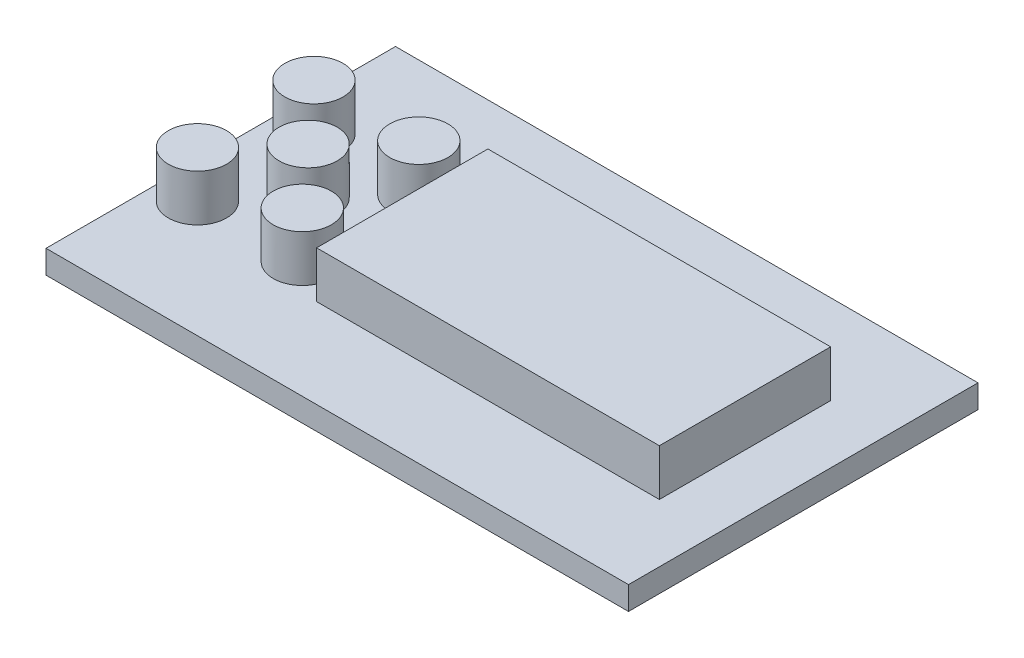
ISO-10303-21;
HEADER;
FILE_DESCRIPTION(('STEP AP214'),'2;1');
FILE_NAME('part.step','',(''),(''),'','','');
FILE_SCHEMA(('AUTOMOTIVE_DESIGN { 1 0 10303 214 1 1 1 1 }'));
ENDSEC;
DATA;
#1=APPLICATION_CONTEXT('core data for automotive mechanical design processes');
#2=APPLICATION_PROTOCOL_DEFINITION('international standard','automotive_design',2000,#1);
#3=PRODUCT_CONTEXT('',#1,'mechanical');
#4=PRODUCT('Part','Part','',(#3));
#5=PRODUCT_RELATED_PRODUCT_CATEGORY('part','',(#4));
#6=PRODUCT_DEFINITION_FORMATION('','',#4);
#7=PRODUCT_DEFINITION_CONTEXT('part definition',#1,'design');
#8=PRODUCT_DEFINITION('design','',#6,#7);
#9=PRODUCT_DEFINITION_SHAPE('','',#8);
#10=(LENGTH_UNIT() NAMED_UNIT(*) SI_UNIT(.MILLI.,.METRE.));
#11=(NAMED_UNIT(*) PLANE_ANGLE_UNIT() SI_UNIT($,.RADIAN.));
#12=(NAMED_UNIT(*) SI_UNIT($,.STERADIAN.) SOLID_ANGLE_UNIT());
#13=UNCERTAINTY_MEASURE_WITH_UNIT(LENGTH_MEASURE(1.E-05),#10,'distance_accuracy_value','');
#14=(GEOMETRIC_REPRESENTATION_CONTEXT(3) GLOBAL_UNCERTAINTY_ASSIGNED_CONTEXT((#13)) GLOBAL_UNIT_ASSIGNED_CONTEXT((#10,
#11,#12)) REPRESENTATION_CONTEXT('',''));
#15=CARTESIAN_POINT('',(0.,0.,0.));
#16=DIRECTION('',(0.,0.,1.));
#17=DIRECTION('',(1.,0.,0.));
#18=AXIS2_PLACEMENT_3D('',#15,#16,#17);
#19=CARTESIAN_POINT('',(0.,-1.,0.));
#20=DIRECTION('',(0.,1.,0.));
#21=DIRECTION('',(0.,0.,1.));
#22=AXIS2_PLACEMENT_3D('',#19,#20,#21);
#23=PLANE('',#22);
#24=DIRECTION('',(0.,0.,-1.));
#25=VECTOR('',#24,1.);
#26=CARTESIAN_POINT('',(0.,-1.,7.5));
#27=LINE('',#26,#25);
#28=CARTESIAN_POINT('',(0.,-1.,7.5));
#29=VERTEX_POINT('',#28);
#30=CARTESIAN_POINT('',(0.,-1.,-7.5));
#31=VERTEX_POINT('',#30);
#32=EDGE_CURVE('E181',#29,#31,#27,.T.);
#33=ORIENTED_EDGE('',*,*,#32,.T.);
#34=DIRECTION('',(1.,0.,0.));
#35=VECTOR('',#34,1.);
#36=CARTESIAN_POINT('',(24.,-1.,-7.5));
#37=LINE('',#36,#35);
#38=CARTESIAN_POINT('',(24.,-1.,-7.5));
#39=VERTEX_POINT('',#38);
#40=EDGE_CURVE('E184',#31,#39,#37,.T.);
#41=ORIENTED_EDGE('',*,*,#40,.T.);
#42=DIRECTION('',(0.,0.,1.));
#43=VECTOR('',#42,1.);
#44=CARTESIAN_POINT('',(24.,-1.,7.5));
#45=LINE('',#44,#43);
#46=CARTESIAN_POINT('',(24.,-1.,7.5));
#47=VERTEX_POINT('',#46);
#48=EDGE_CURVE('E187',#39,#47,#45,.T.);
#49=ORIENTED_EDGE('',*,*,#48,.T.);
#50=DIRECTION('',(-1.,0.,0.));
#51=VECTOR('',#50,1.);
#52=CARTESIAN_POINT('',(24.,-1.,7.5));
#53=LINE('',#52,#51);
#54=EDGE_CURVE('E189',#47,#29,#53,.T.);
#55=ORIENTED_EDGE('',*,*,#54,.T.);
#56=EDGE_LOOP('',(#33,#41,#49,#55));
#57=FACE_BOUND('',#56,.T.);
#58=DIRECTION('',(0.,0.,-1.));
#59=VECTOR('',#58,1.);
#60=CARTESIAN_POINT('',(1.,-1.,6.5));
#61=LINE('',#60,#59);
#62=CARTESIAN_POINT('',(1.,-1.,6.5));
#63=VERTEX_POINT('',#62);
#64=CARTESIAN_POINT('',(1.,-1.,-6.5));
#65=VERTEX_POINT('',#64);
#66=EDGE_CURVE('E54',#63,#65,#61,.T.);
#67=ORIENTED_EDGE('',*,*,#66,.F.);
#68=DIRECTION('',(-1.,0.,0.));
#69=VECTOR('',#68,1.);
#70=CARTESIAN_POINT('',(17.,-1.,6.5));
#71=LINE('',#70,#69);
#72=CARTESIAN_POINT('',(17.,-1.,6.5));
#73=VERTEX_POINT('',#72);
#74=EDGE_CURVE('E58',#73,#63,#71,.T.);
#75=ORIENTED_EDGE('',*,*,#74,.F.);
#76=DIRECTION('',(0.,0.,1.));
#77=VECTOR('',#76,1.);
#78=CARTESIAN_POINT('',(17.,-1.,6.5));
#79=LINE('',#78,#77);
#80=CARTESIAN_POINT('',(17.,-1.,-6.5));
#81=VERTEX_POINT('',#80);
#82=EDGE_CURVE('E571',#81,#73,#79,.T.);
#83=ORIENTED_EDGE('',*,*,#82,.F.);
#84=DIRECTION('',(1.,0.,0.));
#85=VECTOR('',#84,1.);
#86=CARTESIAN_POINT('',(17.,-1.,-6.5));
#87=LINE('',#86,#85);
#88=EDGE_CURVE('E569',#65,#81,#87,.T.);
#89=ORIENTED_EDGE('',*,*,#88,.F.);
#90=EDGE_LOOP('',(#67,#75,#83,#89));
#91=FACE_BOUND('',#90,.T.);
#92=ADVANCED_FACE('F39',(#57,#91),#23,.F.);
#93=CARTESIAN_POINT('',(0.,2.,0.));
#94=DIRECTION('',(0.,-1.,0.));
#95=DIRECTION('',(0.,0.,-1.));
#96=AXIS2_PLACEMENT_3D('',#93,#94,#95);
#97=PLANE('',#96);
#98=CARTESIAN_POINT('',(-17.5,2.,0.));
#99=DIRECTION('',(0.,-1.,0.));
#100=DIRECTION('',(0.,0.,-1.));
#101=AXIS2_PLACEMENT_3D('',#98,#99,#100);
#102=CIRCLE('',#101,2.5);
#103=CARTESIAN_POINT('',(-17.5,2.,-2.5));
#104=VERTEX_POINT('',#103);
#105=EDGE_CURVE('E11',#104,#104,#102,.F.);
#106=ORIENTED_EDGE('',*,*,#105,.F.);
#107=EDGE_LOOP('',(#106));
#108=FACE_BOUND('',#107,.T.);
#109=CARTESIAN_POINT('',(-13.,2.,-5.));
#110=DIRECTION('',(0.,-1.,0.));
#111=DIRECTION('',(0.,0.,-1.));
#112=AXIS2_PLACEMENT_3D('',#109,#110,#111);
#113=CIRCLE('',#112,2.5);
#114=CARTESIAN_POINT('',(-13.,2.,-7.5));
#115=VERTEX_POINT('',#114);
#116=EDGE_CURVE('E47',#115,#115,#113,.F.);
#117=ORIENTED_EDGE('',*,*,#116,.F.);
#118=EDGE_LOOP('',(#117));
#119=FACE_BOUND('',#118,.T.);
#120=CARTESIAN_POINT('',(-13.,2.,5.));
#121=DIRECTION('',(0.,-1.,0.));
#122=DIRECTION('',(0.,0.,-1.));
#123=AXIS2_PLACEMENT_3D('',#120,#121,#122);
#124=CIRCLE('',#123,2.5);
#125=CARTESIAN_POINT('',(-13.,2.,2.5));
#126=VERTEX_POINT('',#125);
#127=EDGE_CURVE('E279',#126,#126,#124,.F.);
#128=ORIENTED_EDGE('',*,*,#127,.F.);
#129=EDGE_LOOP('',(#128));
#130=FACE_BOUND('',#129,.T.);
#131=CARTESIAN_POINT('',(-22.,2.,-5.));
#132=DIRECTION('',(0.,-1.,0.));
#133=DIRECTION('',(0.,0.,-1.));
#134=AXIS2_PLACEMENT_3D('',#131,#132,#133);
#135=CIRCLE('',#134,2.5);
#136=CARTESIAN_POINT('',(-22.,2.,-7.5));
#137=VERTEX_POINT('',#136);
#138=EDGE_CURVE('E276',#137,#137,#135,.F.);
#139=ORIENTED_EDGE('',*,*,#138,.F.);
#140=EDGE_LOOP('',(#139));
#141=FACE_BOUND('',#140,.T.);
#142=CARTESIAN_POINT('',(-22.,2.,5.));
#143=DIRECTION('',(0.,-1.,0.));
#144=DIRECTION('',(0.,0.,-1.));
#145=AXIS2_PLACEMENT_3D('',#142,#143,#144);
#146=CIRCLE('',#145,2.5);
#147=CARTESIAN_POINT('',(-22.,2.,2.5));
#148=VERTEX_POINT('',#147);
#149=EDGE_CURVE('E273',#148,#148,#146,.F.);
#150=ORIENTED_EDGE('',*,*,#149,.F.);
#151=EDGE_LOOP('',(#150));
#152=FACE_BOUND('',#151,.T.);
#153=DIRECTION('',(0.,0.,1.));
#154=VECTOR('',#153,1.);
#155=CARTESIAN_POINT('',(-25.,2.,-15.));
#156=LINE('',#155,#154);
#157=CARTESIAN_POINT('',(-25.,2.,-15.));
#158=VERTEX_POINT('',#157);
#159=CARTESIAN_POINT('',(-25.,2.,15.));
#160=VERTEX_POINT('',#159);
#161=EDGE_CURVE('E244',#158,#160,#156,.T.);
#162=ORIENTED_EDGE('',*,*,#161,.T.);
#163=DIRECTION('',(1.,0.,0.));
#164=VECTOR('',#163,1.);
#165=CARTESIAN_POINT('',(25.,2.,15.));
#166=LINE('',#165,#164);
#167=CARTESIAN_POINT('',(25.,2.,15.));
#168=VERTEX_POINT('',#167);
#169=EDGE_CURVE('E247',#160,#168,#166,.T.);
#170=ORIENTED_EDGE('',*,*,#169,.T.);
#171=DIRECTION('',(0.,0.,-1.));
#172=VECTOR('',#171,1.);
#173=CARTESIAN_POINT('',(25.,2.,-15.));
#174=LINE('',#173,#172);
#175=CARTESIAN_POINT('',(25.,2.,-15.));
#176=VERTEX_POINT('',#175);
#177=EDGE_CURVE('E250',#168,#176,#174,.T.);
#178=ORIENTED_EDGE('',*,*,#177,.T.);
#179=DIRECTION('',(-1.,0.,0.));
#180=VECTOR('',#179,1.);
#181=CARTESIAN_POINT('',(25.,2.,-15.));
#182=LINE('',#181,#180);
#183=EDGE_CURVE('E252',#176,#158,#182,.T.);
#184=ORIENTED_EDGE('',*,*,#183,.T.);
#185=EDGE_LOOP('',(#162,#170,#178,#184));
#186=FACE_BOUND('',#185,.T.);
#187=DIRECTION('',(0.,0.,-1.));
#188=VECTOR('',#187,1.);
#189=CARTESIAN_POINT('',(20.,2.,-7.35));
#190=LINE('',#189,#188);
#191=CARTESIAN_POINT('',(20.,2.,7.35));
#192=VERTEX_POINT('',#191);
#193=CARTESIAN_POINT('',(20.,2.,-7.35));
#194=VERTEX_POINT('',#193);
#195=EDGE_CURVE('E210',#192,#194,#190,.T.);
#196=ORIENTED_EDGE('',*,*,#195,.F.);
#197=DIRECTION('',(1.,0.,0.));
#198=VECTOR('',#197,1.);
#199=CARTESIAN_POINT('',(20.,2.,7.35));
#200=LINE('',#199,#198);
#201=CARTESIAN_POINT('',(-9.41999999999999,2.,7.35));
#202=VERTEX_POINT('',#201);
#203=EDGE_CURVE('E215',#202,#192,#200,.T.);
#204=ORIENTED_EDGE('',*,*,#203,.F.);
#205=DIRECTION('',(0.,0.,1.));
#206=VECTOR('',#205,1.);
#207=CARTESIAN_POINT('',(-9.41999999999999,2.,-7.35));
#208=LINE('',#207,#206);
#209=CARTESIAN_POINT('',(-9.41999999999999,2.,-7.35));
#210=VERTEX_POINT('',#209);
#211=EDGE_CURVE('E227',#210,#202,#208,.T.);
#212=ORIENTED_EDGE('',*,*,#211,.F.);
#213=DIRECTION('',(-1.,0.,0.));
#214=VECTOR('',#213,1.);
#215=CARTESIAN_POINT('',(20.,2.,-7.35));
#216=LINE('',#215,#214);
#217=EDGE_CURVE('E224',#194,#210,#216,.T.);
#218=ORIENTED_EDGE('',*,*,#217,.F.);
#219=EDGE_LOOP('',(#196,#204,#212,#218));
#220=FACE_BOUND('',#219,.T.);
#221=ADVANCED_FACE('F286',(#108,#119,#130,#141,#152,#186,#220),#97,.F.);
#222=CARTESIAN_POINT('',(-25.,2.,-15.));
#223=DIRECTION('',(1.,0.,0.));
#224=DIRECTION('',(0.,0.,-1.));
#225=AXIS2_PLACEMENT_3D('',#222,#223,#224);
#226=PLANE('',#225);
#227=DIRECTION('',(0.,0.,1.));
#228=VECTOR('',#227,1.);
#229=CARTESIAN_POINT('',(-25.,0.,-15.));
#230=LINE('',#229,#228);
#231=CARTESIAN_POINT('',(-25.,0.,-15.));
#232=VERTEX_POINT('',#231);
#233=CARTESIAN_POINT('',(-25.,0.,15.));
#234=VERTEX_POINT('',#233);
#235=EDGE_CURVE('E243',#232,#234,#230,.T.);
#236=ORIENTED_EDGE('',*,*,#235,.T.);
#237=DIRECTION('',(0.,-1.,0.));
#238=VECTOR('',#237,1.);
#239=CARTESIAN_POINT('',(-25.,2.,15.));
#240=LINE('',#239,#238);
#241=EDGE_CURVE('E270',#160,#234,#240,.T.);
#242=ORIENTED_EDGE('',*,*,#241,.F.);
#243=ORIENTED_EDGE('',*,*,#161,.F.);
#244=DIRECTION('',(0.,-1.,0.));
#245=VECTOR('',#244,1.);
#246=CARTESIAN_POINT('',(-25.,2.,-15.));
#247=LINE('',#246,#245);
#248=EDGE_CURVE('E254',#158,#232,#247,.T.);
#249=ORIENTED_EDGE('',*,*,#248,.T.);
#250=EDGE_LOOP('',(#236,#242,#243,#249));
#251=FACE_BOUND('',#250,.T.);
#252=ADVANCED_FACE('F41',(#251),#226,.F.);
#253=CARTESIAN_POINT('',(25.,2.,15.));
#254=DIRECTION('',(0.,0.,-1.));
#255=DIRECTION('',(-1.,0.,0.));
#256=AXIS2_PLACEMENT_3D('',#253,#254,#255);
#257=PLANE('',#256);
#258=DIRECTION('',(1.,0.,0.));
#259=VECTOR('',#258,1.);
#260=CARTESIAN_POINT('',(25.,0.,15.));
#261=LINE('',#260,#259);
#262=CARTESIAN_POINT('',(25.,0.,15.));
#263=VERTEX_POINT('',#262);
#264=EDGE_CURVE('E257',#234,#263,#261,.T.);
#265=ORIENTED_EDGE('',*,*,#264,.T.);
#266=DIRECTION('',(0.,-1.,0.));
#267=VECTOR('',#266,1.);
#268=CARTESIAN_POINT('',(25.,2.,15.));
#269=LINE('',#268,#267);
#270=EDGE_CURVE('E267',#168,#263,#269,.T.);
#271=ORIENTED_EDGE('',*,*,#270,.F.);
#272=ORIENTED_EDGE('',*,*,#169,.F.);
#273=ORIENTED_EDGE('',*,*,#241,.T.);
#274=EDGE_LOOP('',(#265,#271,#272,#273));
#275=FACE_BOUND('',#274,.T.);
#276=ADVANCED_FACE('F591',(#275),#257,.F.);
#277=CARTESIAN_POINT('',(25.,2.,-15.));
#278=DIRECTION('',(-1.,0.,0.));
#279=DIRECTION('',(0.,0.,1.));
#280=AXIS2_PLACEMENT_3D('',#277,#278,#279);
#281=PLANE('',#280);
#282=DIRECTION('',(0.,0.,-1.));
#283=VECTOR('',#282,1.);
#284=CARTESIAN_POINT('',(25.,0.,-15.));
#285=LINE('',#284,#283);
#286=CARTESIAN_POINT('',(25.,0.,-15.));
#287=VERTEX_POINT('',#286);
#288=EDGE_CURVE('E259',#263,#287,#285,.T.);
#289=ORIENTED_EDGE('',*,*,#288,.T.);
#290=DIRECTION('',(0.,-1.,0.));
#291=VECTOR('',#290,1.);
#292=CARTESIAN_POINT('',(25.,2.,-15.));
#293=LINE('',#292,#291);
#294=EDGE_CURVE('E264',#176,#287,#293,.T.);
#295=ORIENTED_EDGE('',*,*,#294,.F.);
#296=ORIENTED_EDGE('',*,*,#177,.F.);
#297=ORIENTED_EDGE('',*,*,#270,.T.);
#298=EDGE_LOOP('',(#289,#295,#296,#297));
#299=FACE_BOUND('',#298,.T.);
#300=ADVANCED_FACE('F598',(#299),#281,.F.);
#301=CARTESIAN_POINT('',(25.,2.,-15.));
#302=DIRECTION('',(0.,0.,1.));
#303=DIRECTION('',(1.,0.,0.));
#304=AXIS2_PLACEMENT_3D('',#301,#302,#303);
#305=PLANE('',#304);
#306=DIRECTION('',(-1.,0.,0.));
#307=VECTOR('',#306,1.);
#308=CARTESIAN_POINT('',(25.,0.,-15.));
#309=LINE('',#308,#307);
#310=EDGE_CURVE('E248',#287,#232,#309,.T.);
#311=ORIENTED_EDGE('',*,*,#310,.T.);
#312=ORIENTED_EDGE('',*,*,#248,.F.);
#313=ORIENTED_EDGE('',*,*,#183,.F.);
#314=ORIENTED_EDGE('',*,*,#294,.T.);
#315=EDGE_LOOP('',(#311,#312,#313,#314));
#316=FACE_BOUND('',#315,.T.);
#317=ADVANCED_FACE('F370',(#316),#305,.F.);
#318=CARTESIAN_POINT('',(0.,0.,0.));
#319=DIRECTION('',(0.,-1.,0.));
#320=DIRECTION('',(0.,0.,-1.));
#321=AXIS2_PLACEMENT_3D('',#318,#319,#320);
#322=PLANE('',#321);
#323=DIRECTION('',(0.,0.,-1.));
#324=VECTOR('',#323,1.);
#325=CARTESIAN_POINT('',(0.,0.,7.5));
#326=LINE('',#325,#324);
#327=CARTESIAN_POINT('',(0.,0.,7.5));
#328=VERTEX_POINT('',#327);
#329=CARTESIAN_POINT('',(0.,0.,-7.5));
#330=VERTEX_POINT('',#329);
#331=EDGE_CURVE('E172',#328,#330,#326,.T.);
#332=ORIENTED_EDGE('',*,*,#331,.F.);
#333=DIRECTION('',(-1.,0.,0.));
#334=VECTOR('',#333,1.);
#335=CARTESIAN_POINT('',(24.,0.,7.5));
#336=LINE('',#335,#334);
#337=CARTESIAN_POINT('',(24.,0.,7.5));
#338=VERTEX_POINT('',#337);
#339=EDGE_CURVE('E185',#338,#328,#336,.T.);
#340=ORIENTED_EDGE('',*,*,#339,.F.);
#341=DIRECTION('',(0.,0.,1.));
#342=VECTOR('',#341,1.);
#343=CARTESIAN_POINT('',(24.,0.,7.5));
#344=LINE('',#343,#342);
#345=CARTESIAN_POINT('',(24.,0.,-7.5));
#346=VERTEX_POINT('',#345);
#347=EDGE_CURVE('E194',#346,#338,#344,.T.);
#348=ORIENTED_EDGE('',*,*,#347,.F.);
#349=DIRECTION('',(1.,0.,0.));
#350=VECTOR('',#349,1.);
#351=CARTESIAN_POINT('',(24.,0.,-7.5));
#352=LINE('',#351,#350);
#353=EDGE_CURVE('E175',#330,#346,#352,.T.);
#354=ORIENTED_EDGE('',*,*,#353,.F.);
#355=EDGE_LOOP('',(#332,#340,#348,#354));
#356=FACE_BOUND('',#355,.T.);
#357=ORIENTED_EDGE('',*,*,#235,.F.);
#358=ORIENTED_EDGE('',*,*,#310,.F.);
#359=ORIENTED_EDGE('',*,*,#288,.F.);
#360=ORIENTED_EDGE('',*,*,#264,.F.);
#361=EDGE_LOOP('',(#357,#358,#359,#360));
#362=FACE_BOUND('',#361,.T.);
#363=ADVANCED_FACE('F324',(#356,#362),#322,.T.);
#364=CARTESIAN_POINT('',(20.,6.,-7.35));
#365=DIRECTION('',(-1.,0.,0.));
#366=DIRECTION('',(0.,0.,1.));
#367=AXIS2_PLACEMENT_3D('',#364,#365,#366);
#368=PLANE('',#367);
#369=ORIENTED_EDGE('',*,*,#195,.T.);
#370=DIRECTION('',(0.,-1.,0.));
#371=VECTOR('',#370,1.);
#372=CARTESIAN_POINT('',(20.,6.,-7.35));
#373=LINE('',#372,#371);
#374=CARTESIAN_POINT('',(20.,6.,-7.35));
#375=VERTEX_POINT('',#374);
#376=EDGE_CURVE('E240',#375,#194,#373,.T.);
#377=ORIENTED_EDGE('',*,*,#376,.F.);
#378=DIRECTION('',(0.,0.,-1.));
#379=VECTOR('',#378,1.);
#380=CARTESIAN_POINT('',(20.,6.,-7.35));
#381=LINE('',#380,#379);
#382=CARTESIAN_POINT('',(20.,6.,7.35));
#383=VERTEX_POINT('',#382);
#384=EDGE_CURVE('E211',#383,#375,#381,.T.);
#385=ORIENTED_EDGE('',*,*,#384,.F.);
#386=DIRECTION('',(0.,-1.,0.));
#387=VECTOR('',#386,1.);
#388=CARTESIAN_POINT('',(20.,6.,7.35));
#389=LINE('',#388,#387);
#390=EDGE_CURVE('E221',#383,#192,#389,.T.);
#391=ORIENTED_EDGE('',*,*,#390,.T.);
#392=EDGE_LOOP('',(#369,#377,#385,#391));
#393=FACE_BOUND('',#392,.T.);
#394=ADVANCED_FACE('F308',(#393),#368,.F.);
#395=CARTESIAN_POINT('',(20.,6.,-7.35));
#396=DIRECTION('',(0.,0.,1.));
#397=DIRECTION('',(1.,0.,0.));
#398=AXIS2_PLACEMENT_3D('',#395,#396,#397);
#399=PLANE('',#398);
#400=ORIENTED_EDGE('',*,*,#217,.T.);
#401=DIRECTION('',(0.,-1.,0.));
#402=VECTOR('',#401,1.);
#403=CARTESIAN_POINT('',(-9.41999999999999,6.,-7.35));
#404=LINE('',#403,#402);
#405=CARTESIAN_POINT('',(-9.41999999999999,6.,-7.35));
#406=VERTEX_POINT('',#405);
#407=EDGE_CURVE('E237',#406,#210,#404,.T.);
#408=ORIENTED_EDGE('',*,*,#407,.F.);
#409=DIRECTION('',(-1.,0.,0.));
#410=VECTOR('',#409,1.);
#411=CARTESIAN_POINT('',(20.,6.,-7.35));
#412=LINE('',#411,#410);
#413=EDGE_CURVE('E214',#375,#406,#412,.T.);
#414=ORIENTED_EDGE('',*,*,#413,.F.);
#415=ORIENTED_EDGE('',*,*,#376,.T.);
#416=EDGE_LOOP('',(#400,#408,#414,#415));
#417=FACE_BOUND('',#416,.T.);
#418=ADVANCED_FACE('F316',(#417),#399,.F.);
#419=CARTESIAN_POINT('',(-9.41999999999999,6.,-7.35));
#420=DIRECTION('',(1.,0.,0.));
#421=DIRECTION('',(0.,0.,-1.));
#422=AXIS2_PLACEMENT_3D('',#419,#420,#421);
#423=PLANE('',#422);
#424=ORIENTED_EDGE('',*,*,#211,.T.);
#425=DIRECTION('',(0.,-1.,0.));
#426=VECTOR('',#425,1.);
#427=CARTESIAN_POINT('',(-9.41999999999999,6.,7.35));
#428=LINE('',#427,#426);
#429=CARTESIAN_POINT('',(-9.41999999999999,6.,7.35));
#430=VERTEX_POINT('',#429);
#431=EDGE_CURVE('E234',#430,#202,#428,.T.);
#432=ORIENTED_EDGE('',*,*,#431,.F.);
#433=DIRECTION('',(0.,0.,1.));
#434=VECTOR('',#433,1.);
#435=CARTESIAN_POINT('',(-9.41999999999999,6.,-7.35));
#436=LINE('',#435,#434);
#437=EDGE_CURVE('E217',#406,#430,#436,.T.);
#438=ORIENTED_EDGE('',*,*,#437,.F.);
#439=ORIENTED_EDGE('',*,*,#407,.T.);
#440=EDGE_LOOP('',(#424,#432,#438,#439));
#441=FACE_BOUND('',#440,.T.);
#442=ADVANCED_FACE('F314',(#441),#423,.F.);
#443=CARTESIAN_POINT('',(20.,6.,7.35));
#444=DIRECTION('',(0.,0.,-1.));
#445=DIRECTION('',(-1.,0.,0.));
#446=AXIS2_PLACEMENT_3D('',#443,#444,#445);
#447=PLANE('',#446);
#448=ORIENTED_EDGE('',*,*,#203,.T.);
#449=ORIENTED_EDGE('',*,*,#390,.F.);
#450=DIRECTION('',(1.,0.,0.));
#451=VECTOR('',#450,1.);
#452=CARTESIAN_POINT('',(20.,6.,7.35));
#453=LINE('',#452,#451);
#454=EDGE_CURVE('E219',#430,#383,#453,.T.);
#455=ORIENTED_EDGE('',*,*,#454,.F.);
#456=ORIENTED_EDGE('',*,*,#431,.T.);
#457=EDGE_LOOP('',(#448,#449,#455,#456));
#458=FACE_BOUND('',#457,.T.);
#459=ADVANCED_FACE('F304',(#458),#447,.F.);
#460=CARTESIAN_POINT('',(0.,6.,0.));
#461=DIRECTION('',(0.,-1.,0.));
#462=DIRECTION('',(0.,0.,-1.));
#463=AXIS2_PLACEMENT_3D('',#460,#461,#462);
#464=PLANE('',#463);
#465=ORIENTED_EDGE('',*,*,#384,.T.);
#466=ORIENTED_EDGE('',*,*,#413,.T.);
#467=ORIENTED_EDGE('',*,*,#437,.T.);
#468=ORIENTED_EDGE('',*,*,#454,.T.);
#469=EDGE_LOOP('',(#465,#466,#467,#468));
#470=FACE_BOUND('',#469,.T.);
#471=ADVANCED_FACE('F310',(#470),#464,.F.);
#472=CARTESIAN_POINT('',(0.,-1.,7.5));
#473=DIRECTION('',(1.,0.,0.));
#474=DIRECTION('',(0.,0.,-1.));
#475=AXIS2_PLACEMENT_3D('',#472,#473,#474);
#476=PLANE('',#475);
#477=ORIENTED_EDGE('',*,*,#331,.T.);
#478=DIRECTION('',(0.,1.,0.));
#479=VECTOR('',#478,1.);
#480=CARTESIAN_POINT('',(0.,-1.,-7.5));
#481=LINE('',#480,#479);
#482=EDGE_CURVE('E207',#31,#330,#481,.T.);
#483=ORIENTED_EDGE('',*,*,#482,.F.);
#484=ORIENTED_EDGE('',*,*,#32,.F.);
#485=DIRECTION('',(0.,1.,0.));
#486=VECTOR('',#485,1.);
#487=CARTESIAN_POINT('',(0.,-1.,7.5));
#488=LINE('',#487,#486);
#489=EDGE_CURVE('E190',#29,#328,#488,.T.);
#490=ORIENTED_EDGE('',*,*,#489,.T.);
#491=EDGE_LOOP('',(#477,#483,#484,#490));
#492=FACE_BOUND('',#491,.T.);
#493=ADVANCED_FACE('F347',(#492),#476,.F.);
#494=CARTESIAN_POINT('',(24.,-1.,-7.5));
#495=DIRECTION('',(0.,0.,1.));
#496=DIRECTION('',(1.,0.,0.));
#497=AXIS2_PLACEMENT_3D('',#494,#495,#496);
#498=PLANE('',#497);
#499=ORIENTED_EDGE('',*,*,#353,.T.);
#500=DIRECTION('',(0.,1.,0.));
#501=VECTOR('',#500,1.);
#502=CARTESIAN_POINT('',(24.,-1.,-7.5));
#503=LINE('',#502,#501);
#504=EDGE_CURVE('E204',#39,#346,#503,.T.);
#505=ORIENTED_EDGE('',*,*,#504,.F.);
#506=ORIENTED_EDGE('',*,*,#40,.F.);
#507=ORIENTED_EDGE('',*,*,#482,.T.);
#508=EDGE_LOOP('',(#499,#505,#506,#507));
#509=FACE_BOUND('',#508,.T.);
#510=ADVANCED_FACE('F343',(#509),#498,.F.);
#511=CARTESIAN_POINT('',(24.,-1.,7.5));
#512=DIRECTION('',(-1.,0.,0.));
#513=DIRECTION('',(0.,0.,1.));
#514=AXIS2_PLACEMENT_3D('',#511,#512,#513);
#515=PLANE('',#514);
#516=ORIENTED_EDGE('',*,*,#347,.T.);
#517=DIRECTION('',(0.,1.,0.));
#518=VECTOR('',#517,1.);
#519=CARTESIAN_POINT('',(24.,-1.,7.5));
#520=LINE('',#519,#518);
#521=EDGE_CURVE('E201',#47,#338,#520,.T.);
#522=ORIENTED_EDGE('',*,*,#521,.F.);
#523=ORIENTED_EDGE('',*,*,#48,.F.);
#524=ORIENTED_EDGE('',*,*,#504,.T.);
#525=EDGE_LOOP('',(#516,#522,#523,#524));
#526=FACE_BOUND('',#525,.T.);
#527=ADVANCED_FACE('F339',(#526),#515,.F.);
#528=CARTESIAN_POINT('',(24.,-1.,7.5));
#529=DIRECTION('',(0.,0.,-1.));
#530=DIRECTION('',(-1.,0.,0.));
#531=AXIS2_PLACEMENT_3D('',#528,#529,#530);
#532=PLANE('',#531);
#533=ORIENTED_EDGE('',*,*,#339,.T.);
#534=ORIENTED_EDGE('',*,*,#489,.F.);
#535=ORIENTED_EDGE('',*,*,#54,.F.);
#536=ORIENTED_EDGE('',*,*,#521,.T.);
#537=EDGE_LOOP('',(#533,#534,#535,#536));
#538=FACE_BOUND('',#537,.T.);
#539=ADVANCED_FACE('F336',(#538),#532,.F.);
#540=CARTESIAN_POINT('',(1.,-3.,6.5));
#541=DIRECTION('',(1.,0.,0.));
#542=DIRECTION('',(0.,0.,-1.));
#543=AXIS2_PLACEMENT_3D('',#540,#541,#542);
#544=PLANE('',#543);
#545=ORIENTED_EDGE('',*,*,#66,.T.);
#546=DIRECTION('',(0.,1.,0.));
#547=VECTOR('',#546,1.);
#548=CARTESIAN_POINT('',(1.,-3.,-6.5));
#549=LINE('',#548,#547);
#550=CARTESIAN_POINT('',(1.,-3.,-6.5));
#551=VERTEX_POINT('',#550);
#552=EDGE_CURVE('E155',#551,#65,#549,.T.);
#553=ORIENTED_EDGE('',*,*,#552,.F.);
#554=DIRECTION('',(0.,0.,-1.));
#555=VECTOR('',#554,1.);
#556=CARTESIAN_POINT('',(1.,-3.,6.5));
#557=LINE('',#556,#555);
#558=CARTESIAN_POINT('',(1.,-3.,6.5));
#559=VERTEX_POINT('',#558);
#560=EDGE_CURVE('E161',#559,#551,#557,.T.);
#561=ORIENTED_EDGE('',*,*,#560,.F.);
#562=DIRECTION('',(0.,1.,0.));
#563=VECTOR('',#562,1.);
#564=CARTESIAN_POINT('',(1.,-3.,6.5));
#565=LINE('',#564,#563);
#566=EDGE_CURVE('E567',#559,#63,#565,.T.);
#567=ORIENTED_EDGE('',*,*,#566,.T.);
#568=EDGE_LOOP('',(#545,#553,#561,#567));
#569=FACE_BOUND('',#568,.T.);
#570=ADVANCED_FACE('F171',(#569),#544,.F.);
#571=CARTESIAN_POINT('',(17.,-3.,-6.5));
#572=DIRECTION('',(0.,0.,1.));
#573=DIRECTION('',(1.,0.,0.));
#574=AXIS2_PLACEMENT_3D('',#571,#572,#573);
#575=PLANE('',#574);
#576=ORIENTED_EDGE('',*,*,#88,.T.);
#577=DIRECTION('',(0.,1.,0.));
#578=VECTOR('',#577,1.);
#579=CARTESIAN_POINT('',(17.,-3.,-6.5));
#580=LINE('',#579,#578);
#581=CARTESIAN_POINT('',(17.,-3.,-6.5));
#582=VERTEX_POINT('',#581);
#583=EDGE_CURVE('E157',#582,#81,#580,.T.);
#584=ORIENTED_EDGE('',*,*,#583,.F.);
#585=DIRECTION('',(1.,0.,0.));
#586=VECTOR('',#585,1.);
#587=CARTESIAN_POINT('',(17.,-3.,-6.5));
#588=LINE('',#587,#586);
#589=EDGE_CURVE('E150',#551,#582,#588,.T.);
#590=ORIENTED_EDGE('',*,*,#589,.F.);
#591=ORIENTED_EDGE('',*,*,#552,.T.);
#592=EDGE_LOOP('',(#576,#584,#590,#591));
#593=FACE_BOUND('',#592,.T.);
#594=ADVANCED_FACE('F153',(#593),#575,.F.);
#595=CARTESIAN_POINT('',(17.,-3.,6.5));
#596=DIRECTION('',(-1.,0.,0.));
#597=DIRECTION('',(0.,0.,1.));
#598=AXIS2_PLACEMENT_3D('',#595,#596,#597);
#599=PLANE('',#598);
#600=ORIENTED_EDGE('',*,*,#82,.T.);
#601=DIRECTION('',(0.,1.,0.));
#602=VECTOR('',#601,1.);
#603=CARTESIAN_POINT('',(17.,-3.,6.5));
#604=LINE('',#603,#602);
#605=CARTESIAN_POINT('',(17.,-3.,6.5));
#606=VERTEX_POINT('',#605);
#607=EDGE_CURVE('E177',#606,#73,#604,.T.);
#608=ORIENTED_EDGE('',*,*,#607,.F.);
#609=DIRECTION('',(0.,0.,1.));
#610=VECTOR('',#609,1.);
#611=CARTESIAN_POINT('',(17.,-3.,6.5));
#612=LINE('',#611,#610);
#613=EDGE_CURVE('E160',#582,#606,#612,.T.);
#614=ORIENTED_EDGE('',*,*,#613,.F.);
#615=ORIENTED_EDGE('',*,*,#583,.T.);
#616=EDGE_LOOP('',(#600,#608,#614,#615));
#617=FACE_BOUND('',#616,.T.);
#618=ADVANCED_FACE('F414',(#617),#599,.F.);
#619=CARTESIAN_POINT('',(17.,-3.,6.5));
#620=DIRECTION('',(0.,0.,-1.));
#621=DIRECTION('',(-1.,0.,0.));
#622=AXIS2_PLACEMENT_3D('',#619,#620,#621);
#623=PLANE('',#622);
#624=ORIENTED_EDGE('',*,*,#74,.T.);
#625=ORIENTED_EDGE('',*,*,#566,.F.);
#626=DIRECTION('',(-1.,0.,0.));
#627=VECTOR('',#626,1.);
#628=CARTESIAN_POINT('',(17.,-3.,6.5));
#629=LINE('',#628,#627);
#630=EDGE_CURVE('E166',#606,#559,#629,.T.);
#631=ORIENTED_EDGE('',*,*,#630,.F.);
#632=ORIENTED_EDGE('',*,*,#607,.T.);
#633=EDGE_LOOP('',(#624,#625,#631,#632));
#634=FACE_BOUND('',#633,.T.);
#635=ADVANCED_FACE('F422',(#634),#623,.F.);
#636=CARTESIAN_POINT('',(0.,-3.,0.));
#637=DIRECTION('',(0.,1.,0.));
#638=DIRECTION('',(0.,0.,1.));
#639=AXIS2_PLACEMENT_3D('',#636,#637,#638);
#640=PLANE('',#639);
#641=ORIENTED_EDGE('',*,*,#560,.T.);
#642=ORIENTED_EDGE('',*,*,#589,.T.);
#643=ORIENTED_EDGE('',*,*,#613,.T.);
#644=ORIENTED_EDGE('',*,*,#630,.T.);
#645=EDGE_LOOP('',(#641,#642,#643,#644));
#646=FACE_BOUND('',#645,.T.);
#647=ADVANCED_FACE('F164',(#646),#640,.F.);
#648=CARTESIAN_POINT('',(-22.,6.,5.));
#649=DIRECTION('',(0.,-1.,0.));
#650=DIRECTION('',(0.,0.,-1.));
#651=AXIS2_PLACEMENT_3D('',#648,#649,#650);
#652=CYLINDRICAL_SURFACE('',#651,2.5);
#653=CARTESIAN_POINT('',(-22.,6.,5.));
#654=DIRECTION('',(0.,1.,0.));
#655=DIRECTION('',(0.,0.,1.));
#656=AXIS2_PLACEMENT_3D('',#653,#654,#655);
#657=CIRCLE('',#656,2.5);
#658=CARTESIAN_POINT('',(-22.,6.,7.5));
#659=VERTEX_POINT('',#658);
#660=EDGE_CURVE('E562',#659,#659,#657,.T.);
#661=ORIENTED_EDGE('',*,*,#660,.F.);
#662=EDGE_LOOP('',(#661));
#663=FACE_BOUND('',#662,.T.);
#664=ORIENTED_EDGE('',*,*,#149,.T.);
#665=EDGE_LOOP('',(#664));
#666=FACE_BOUND('',#665,.T.);
#667=ADVANCED_FACE('F440',(#663,#666),#652,.T.);
#668=CARTESIAN_POINT('',(-22.,6.,5.));
#669=DIRECTION('',(0.,1.,0.));
#670=DIRECTION('',(0.,0.,1.));
#671=AXIS2_PLACEMENT_3D('',#668,#669,#670);
#672=PLANE('',#671);
#673=ORIENTED_EDGE('',*,*,#660,.T.);
#674=EDGE_LOOP('',(#673));
#675=FACE_BOUND('',#674,.T.);
#676=ADVANCED_FACE('F455',(#675),#672,.T.);
#677=CARTESIAN_POINT('',(-22.,6.,-5.));
#678=DIRECTION('',(0.,-1.,0.));
#679=DIRECTION('',(0.,0.,-1.));
#680=AXIS2_PLACEMENT_3D('',#677,#678,#679);
#681=CYLINDRICAL_SURFACE('',#680,2.5);
#682=CARTESIAN_POINT('',(-22.,6.,-5.));
#683=DIRECTION('',(0.,1.,0.));
#684=DIRECTION('',(0.,0.,1.));
#685=AXIS2_PLACEMENT_3D('',#682,#683,#684);
#686=CIRCLE('',#685,2.5);
#687=CARTESIAN_POINT('',(-22.,6.,-2.5));
#688=VERTEX_POINT('',#687);
#689=EDGE_CURVE('E559',#688,#688,#686,.T.);
#690=ORIENTED_EDGE('',*,*,#689,.F.);
#691=EDGE_LOOP('',(#690));
#692=FACE_BOUND('',#691,.T.);
#693=ORIENTED_EDGE('',*,*,#138,.T.);
#694=EDGE_LOOP('',(#693));
#695=FACE_BOUND('',#694,.T.);
#696=ADVANCED_FACE('F465',(#692,#695),#681,.T.);
#697=CARTESIAN_POINT('',(-22.,6.,-5.));
#698=DIRECTION('',(0.,1.,0.));
#699=DIRECTION('',(0.,0.,1.));
#700=AXIS2_PLACEMENT_3D('',#697,#698,#699);
#701=PLANE('',#700);
#702=ORIENTED_EDGE('',*,*,#689,.T.);
#703=EDGE_LOOP('',(#702));
#704=FACE_BOUND('',#703,.T.);
#705=ADVANCED_FACE('F475',(#704),#701,.T.);
#706=CARTESIAN_POINT('',(-13.,6.,5.));
#707=DIRECTION('',(0.,-1.,0.));
#708=DIRECTION('',(0.,0.,-1.));
#709=AXIS2_PLACEMENT_3D('',#706,#707,#708);
#710=CYLINDRICAL_SURFACE('',#709,2.5);
#711=CARTESIAN_POINT('',(-13.,6.,5.));
#712=DIRECTION('',(0.,1.,0.));
#713=DIRECTION('',(0.,0.,1.));
#714=AXIS2_PLACEMENT_3D('',#711,#712,#713);
#715=CIRCLE('',#714,2.5);
#716=CARTESIAN_POINT('',(-13.,6.,7.5));
#717=VERTEX_POINT('',#716);
#718=EDGE_CURVE('E554',#717,#717,#715,.T.);
#719=ORIENTED_EDGE('',*,*,#718,.F.);
#720=EDGE_LOOP('',(#719));
#721=FACE_BOUND('',#720,.T.);
#722=ORIENTED_EDGE('',*,*,#127,.T.);
#723=EDGE_LOOP('',(#722));
#724=FACE_BOUND('',#723,.T.);
#725=ADVANCED_FACE('F485',(#721,#724),#710,.T.);
#726=CARTESIAN_POINT('',(-13.,6.,5.));
#727=DIRECTION('',(0.,1.,0.));
#728=DIRECTION('',(0.,0.,1.));
#729=AXIS2_PLACEMENT_3D('',#726,#727,#728);
#730=PLANE('',#729);
#731=ORIENTED_EDGE('',*,*,#718,.T.);
#732=EDGE_LOOP('',(#731));
#733=FACE_BOUND('',#732,.T.);
#734=ADVANCED_FACE('F495',(#733),#730,.T.);
#735=CARTESIAN_POINT('',(-13.,6.,-5.));
#736=DIRECTION('',(0.,-1.,0.));
#737=DIRECTION('',(0.,0.,-1.));
#738=AXIS2_PLACEMENT_3D('',#735,#736,#737);
#739=CYLINDRICAL_SURFACE('',#738,2.5);
#740=CARTESIAN_POINT('',(-13.,6.,-5.));
#741=DIRECTION('',(0.,1.,0.));
#742=DIRECTION('',(0.,0.,1.));
#743=AXIS2_PLACEMENT_3D('',#740,#741,#742);
#744=CIRCLE('',#743,2.5);
#745=CARTESIAN_POINT('',(-13.,6.,-2.5));
#746=VERTEX_POINT('',#745);
#747=EDGE_CURVE('E551',#746,#746,#744,.T.);
#748=ORIENTED_EDGE('',*,*,#747,.F.);
#749=EDGE_LOOP('',(#748));
#750=FACE_BOUND('',#749,.T.);
#751=ORIENTED_EDGE('',*,*,#116,.T.);
#752=EDGE_LOOP('',(#751));
#753=FACE_BOUND('',#752,.T.);
#754=ADVANCED_FACE('F284',(#750,#753),#739,.T.);
#755=CARTESIAN_POINT('',(-13.,6.,-5.));
#756=DIRECTION('',(0.,1.,0.));
#757=DIRECTION('',(0.,0.,1.));
#758=AXIS2_PLACEMENT_3D('',#755,#756,#757);
#759=PLANE('',#758);
#760=ORIENTED_EDGE('',*,*,#747,.T.);
#761=EDGE_LOOP('',(#760));
#762=FACE_BOUND('',#761,.T.);
#763=ADVANCED_FACE('F514',(#762),#759,.T.);
#764=CARTESIAN_POINT('',(-17.5,6.,0.));
#765=DIRECTION('',(0.,-1.,0.));
#766=DIRECTION('',(0.,0.,-1.));
#767=AXIS2_PLACEMENT_3D('',#764,#765,#766);
#768=CYLINDRICAL_SURFACE('',#767,2.5);
#769=CARTESIAN_POINT('',(-17.5,6.,0.));
#770=DIRECTION('',(0.,1.,0.));
#771=DIRECTION('',(0.,0.,1.));
#772=AXIS2_PLACEMENT_3D('',#769,#770,#771);
#773=CIRCLE('',#772,2.5);
#774=CARTESIAN_POINT('',(-17.5,6.,2.5));
#775=VERTEX_POINT('',#774);
#776=EDGE_CURVE('E550',#775,#775,#773,.T.);
#777=ORIENTED_EDGE('',*,*,#776,.F.);
#778=EDGE_LOOP('',(#777));
#779=FACE_BOUND('',#778,.T.);
#780=ORIENTED_EDGE('',*,*,#105,.T.);
#781=EDGE_LOOP('',(#780));
#782=FACE_BOUND('',#781,.T.);
#783=ADVANCED_FACE('F524',(#779,#782),#768,.T.);
#784=CARTESIAN_POINT('',(-17.5,6.,0.));
#785=DIRECTION('',(0.,1.,0.));
#786=DIRECTION('',(0.,0.,1.));
#787=AXIS2_PLACEMENT_3D('',#784,#785,#786);
#788=PLANE('',#787);
#789=ORIENTED_EDGE('',*,*,#776,.T.);
#790=EDGE_LOOP('',(#789));
#791=FACE_BOUND('',#790,.T.);
#792=ADVANCED_FACE('F534',(#791),#788,.T.);
#793=CLOSED_SHELL('',(#92,#221,#252,#276,#300,#317,#363,#394,#418,#442,#459,#471,#493,#510,#527,
#539,#570,#594,#618,#635,#647,#667,#676,#696,#705,#725,#734,#754,#763,#783,#792));
#794=MANIFOLD_SOLID_BREP('B2',#793);
#795=ADVANCED_BREP_SHAPE_REPRESENTATION('',(#18,#794),#14);
#796=SHAPE_DEFINITION_REPRESENTATION(#9,#795);
ENDSEC;
END-ISO-10303-21;
